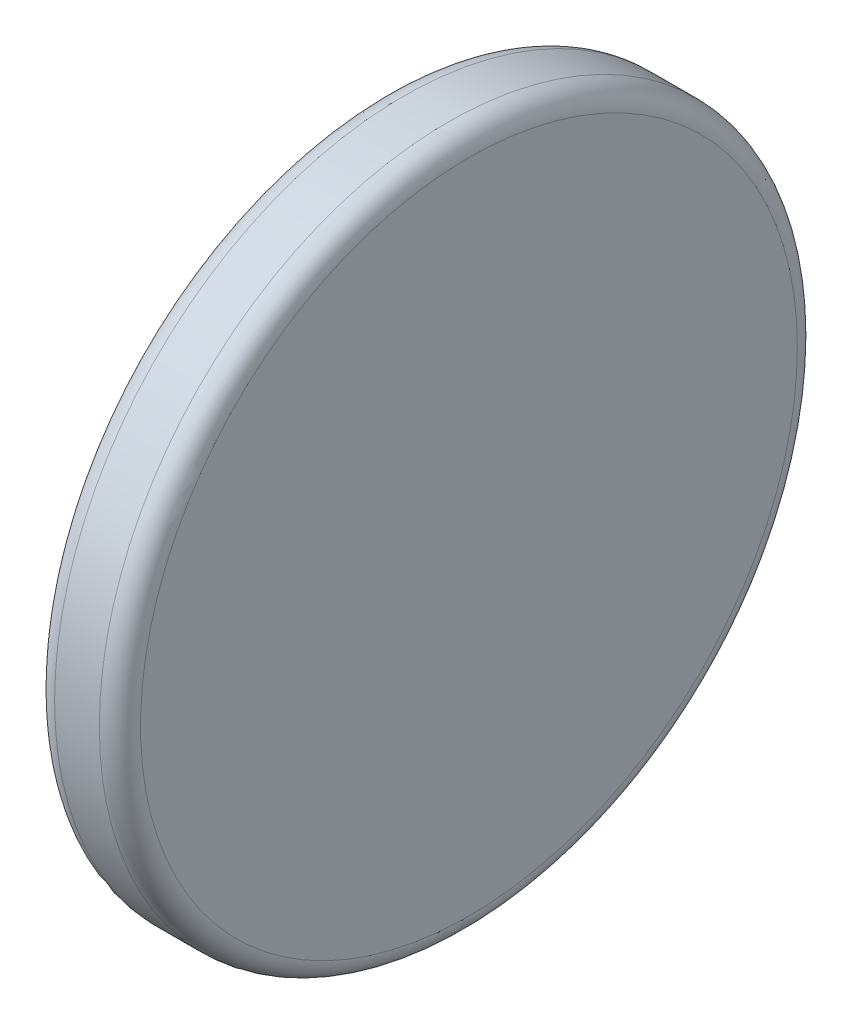
ISO-10303-21;
HEADER;
FILE_DESCRIPTION(('STEP AP214'),'2;1');
FILE_NAME('part.step','',(''),(''),'','','');
FILE_SCHEMA(('AUTOMOTIVE_DESIGN { 1 0 10303 214 1 1 1 1 }'));
ENDSEC;
DATA;
#1=APPLICATION_CONTEXT('core data for automotive mechanical design processes');
#2=APPLICATION_PROTOCOL_DEFINITION('international standard','automotive_design',2000,#1);
#3=PRODUCT_CONTEXT('',#1,'mechanical');
#4=PRODUCT('Part','Part','',(#3));
#5=PRODUCT_RELATED_PRODUCT_CATEGORY('part','',(#4));
#6=PRODUCT_DEFINITION_FORMATION('','',#4);
#7=PRODUCT_DEFINITION_CONTEXT('part definition',#1,'design');
#8=PRODUCT_DEFINITION('design','',#6,#7);
#9=PRODUCT_DEFINITION_SHAPE('','',#8);
#10=(LENGTH_UNIT() NAMED_UNIT(*) SI_UNIT(.MILLI.,.METRE.));
#11=(NAMED_UNIT(*) PLANE_ANGLE_UNIT() SI_UNIT($,.RADIAN.));
#12=(NAMED_UNIT(*) SI_UNIT($,.STERADIAN.) SOLID_ANGLE_UNIT());
#13=UNCERTAINTY_MEASURE_WITH_UNIT(LENGTH_MEASURE(1.E-05),#10,'distance_accuracy_value','');
#14=(GEOMETRIC_REPRESENTATION_CONTEXT(3) GLOBAL_UNCERTAINTY_ASSIGNED_CONTEXT((#13)) GLOBAL_UNIT_ASSIGNED_CONTEXT((#10,
#11,#12)) REPRESENTATION_CONTEXT('',''));
#15=CARTESIAN_POINT('',(0.,0.,0.));
#16=DIRECTION('',(0.,0.,1.));
#17=DIRECTION('',(1.,0.,0.));
#18=AXIS2_PLACEMENT_3D('',#15,#16,#17);
#19=CARTESIAN_POINT('',(25.,0.,0.));
#20=DIRECTION('',(-1.,0.,0.));
#21=DIRECTION('',(0.,0.,1.));
#22=AXIS2_PLACEMENT_3D('',#19,#20,#21);
#23=CYLINDRICAL_SURFACE('',#22,203.2);
#24=CARTESIAN_POINT('',(-13.,0.,0.));
#25=DIRECTION('',(1.,0.,0.));
#26=DIRECTION('',(0.,0.,-1.));
#27=AXIS2_PLACEMENT_3D('',#24,#25,#26);
#28=CIRCLE('',#27,203.2);
#29=CARTESIAN_POINT('',(-13.,0.,-203.2));
#30=VERTEX_POINT('',#29);
#31=EDGE_CURVE('E43',#30,#30,#28,.T.);
#32=ORIENTED_EDGE('',*,*,#31,.T.);
#33=EDGE_LOOP('',(#32));
#34=FACE_BOUND('',#33,.T.);
#35=CARTESIAN_POINT('',(13.,0.,0.));
#36=DIRECTION('',(1.,0.,0.));
#37=DIRECTION('',(0.,0.,-1.));
#38=AXIS2_PLACEMENT_3D('',#35,#36,#37);
#39=CIRCLE('',#38,203.2);
#40=CARTESIAN_POINT('',(13.,0.,-203.2));
#41=VERTEX_POINT('',#40);
#42=EDGE_CURVE('E47',#41,#41,#39,.F.);
#43=ORIENTED_EDGE('',*,*,#42,.T.);
#44=EDGE_LOOP('',(#43));
#45=FACE_BOUND('',#44,.T.);
#46=ADVANCED_FACE('F32',(#34,#45),#23,.T.);
#47=CARTESIAN_POINT('',(25.,0.,0.));
#48=DIRECTION('',(1.,0.,0.));
#49=DIRECTION('',(0.,0.,-1.));
#50=AXIS2_PLACEMENT_3D('',#47,#48,#49);
#51=PLANE('',#50);
#52=CARTESIAN_POINT('',(25.,0.,0.));
#53=DIRECTION('',(1.,0.,0.));
#54=DIRECTION('',(0.,0.,-1.));
#55=AXIS2_PLACEMENT_3D('',#52,#53,#54);
#56=CIRCLE('',#55,191.2);
#57=CARTESIAN_POINT('',(25.,0.,-191.2));
#58=VERTEX_POINT('',#57);
#59=EDGE_CURVE('E10',#58,#58,#56,.T.);
#60=ORIENTED_EDGE('',*,*,#59,.T.);
#61=EDGE_LOOP('',(#60));
#62=FACE_BOUND('',#61,.T.);
#63=ADVANCED_FACE('F63',(#62),#51,.T.);
#64=CARTESIAN_POINT('',(-25.,0.,0.));
#65=DIRECTION('',(1.,0.,0.));
#66=DIRECTION('',(0.,0.,-1.));
#67=AXIS2_PLACEMENT_3D('',#64,#65,#66);
#68=PLANE('',#67);
#69=CARTESIAN_POINT('',(-25.,0.,0.));
#70=DIRECTION('',(1.,0.,0.));
#71=DIRECTION('',(0.,0.,-1.));
#72=AXIS2_PLACEMENT_3D('',#69,#70,#71);
#73=CIRCLE('',#72,191.2);
#74=CARTESIAN_POINT('',(-25.,0.,-191.2));
#75=VERTEX_POINT('',#74);
#76=EDGE_CURVE('E39',#75,#75,#73,.F.);
#77=ORIENTED_EDGE('',*,*,#76,.T.);
#78=EDGE_LOOP('',(#77));
#79=FACE_BOUND('',#78,.T.);
#80=ADVANCED_FACE('F60',(#79),#68,.F.);
#81=CARTESIAN_POINT('',(-13.,0.,0.));
#82=DIRECTION('',(1.,0.,0.));
#83=DIRECTION('',(0.,0.,-1.));
#84=AXIS2_PLACEMENT_3D('',#81,#82,#83);
#85=TOROIDAL_SURFACE('',#84,191.2,12.);
#86=ORIENTED_EDGE('',*,*,#76,.F.);
#87=EDGE_LOOP('',(#86));
#88=FACE_BOUND('',#87,.T.);
#89=ORIENTED_EDGE('',*,*,#31,.F.);
#90=EDGE_LOOP('',(#89));
#91=FACE_BOUND('',#90,.T.);
#92=ADVANCED_FACE('F56',(#88,#91),#85,.T.);
#93=CARTESIAN_POINT('',(13.,0.,0.));
#94=DIRECTION('',(1.,0.,0.));
#95=DIRECTION('',(0.,0.,-1.));
#96=AXIS2_PLACEMENT_3D('',#93,#94,#95);
#97=TOROIDAL_SURFACE('',#96,191.2,12.);
#98=ORIENTED_EDGE('',*,*,#42,.F.);
#99=EDGE_LOOP('',(#98));
#100=FACE_BOUND('',#99,.T.);
#101=ORIENTED_EDGE('',*,*,#59,.F.);
#102=EDGE_LOOP('',(#101));
#103=FACE_BOUND('',#102,.T.);
#104=ADVANCED_FACE('F34',(#100,#103),#97,.T.);
#105=CLOSED_SHELL('',(#46,#63,#80,#92,#104));
#106=MANIFOLD_SOLID_BREP('B2',#105);
#107=ADVANCED_BREP_SHAPE_REPRESENTATION('',(#18,#106),#14);
#108=SHAPE_DEFINITION_REPRESENTATION(#9,#107);
ENDSEC;
END-ISO-10303-21;
